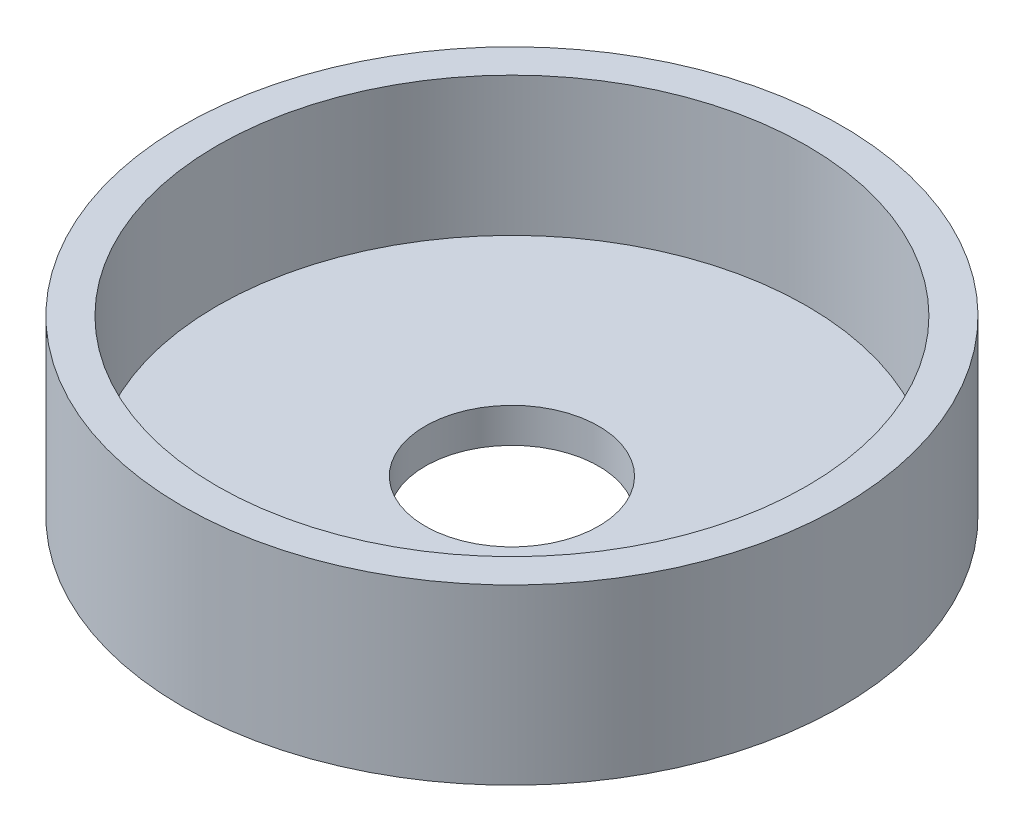
ISO-10303-21;
HEADER;
FILE_DESCRIPTION(('STEP AP214'),'2;1');
FILE_NAME('part.step','',(''),(''),'','','');
FILE_SCHEMA(('AUTOMOTIVE_DESIGN { 1 0 10303 214 1 1 1 1 }'));
ENDSEC;
DATA;
#1=APPLICATION_CONTEXT('core data for automotive mechanical design processes');
#2=APPLICATION_PROTOCOL_DEFINITION('international standard','automotive_design',2000,#1);
#3=PRODUCT_CONTEXT('',#1,'mechanical');
#4=PRODUCT('Part','Part','',(#3));
#5=PRODUCT_RELATED_PRODUCT_CATEGORY('part','',(#4));
#6=PRODUCT_DEFINITION_FORMATION('','',#4);
#7=PRODUCT_DEFINITION_CONTEXT('part definition',#1,'design');
#8=PRODUCT_DEFINITION('design','',#6,#7);
#9=PRODUCT_DEFINITION_SHAPE('','',#8);
#10=(LENGTH_UNIT() NAMED_UNIT(*) SI_UNIT(.MILLI.,.METRE.));
#11=(NAMED_UNIT(*) PLANE_ANGLE_UNIT() SI_UNIT($,.RADIAN.));
#12=(NAMED_UNIT(*) SI_UNIT($,.STERADIAN.) SOLID_ANGLE_UNIT());
#13=UNCERTAINTY_MEASURE_WITH_UNIT(LENGTH_MEASURE(1.E-05),#10,'distance_accuracy_value','');
#14=(GEOMETRIC_REPRESENTATION_CONTEXT(3) GLOBAL_UNCERTAINTY_ASSIGNED_CONTEXT((#13)) GLOBAL_UNIT_ASSIGNED_CONTEXT((#10,
#11,#12)) REPRESENTATION_CONTEXT('',''));
#15=CARTESIAN_POINT('',(0.,0.,0.));
#16=DIRECTION('',(0.,0.,1.));
#17=DIRECTION('',(1.,0.,0.));
#18=AXIS2_PLACEMENT_3D('',#15,#16,#17);
#19=CARTESIAN_POINT('',(0.,1.,0.));
#20=DIRECTION('',(0.,-1.,0.));
#21=DIRECTION('',(0.,0.,-1.));
#22=AXIS2_PLACEMENT_3D('',#19,#20,#21);
#23=CYLINDRICAL_SURFACE('',#22,2.5);
#24=CARTESIAN_POINT('',(0.,1.,0.));
#25=DIRECTION('',(0.,1.,0.));
#26=DIRECTION('',(0.,0.,1.));
#27=AXIS2_PLACEMENT_3D('',#24,#25,#26);
#28=CIRCLE('',#27,2.5);
#29=CARTESIAN_POINT('',(0.,1.,2.5));
#30=VERTEX_POINT('',#29);
#31=EDGE_CURVE('E42',#30,#30,#28,.T.);
#32=ORIENTED_EDGE('',*,*,#31,.T.);
#33=EDGE_LOOP('',(#32));
#34=FACE_BOUND('',#33,.T.);
#35=CARTESIAN_POINT('',(0.,0.,0.));
#36=DIRECTION('',(0.,1.,0.));
#37=DIRECTION('',(0.,0.,1.));
#38=AXIS2_PLACEMENT_3D('',#35,#36,#37);
#39=CIRCLE('',#38,2.5);
#40=CARTESIAN_POINT('',(0.,0.,2.5));
#41=VERTEX_POINT('',#40);
#42=EDGE_CURVE('E51',#41,#41,#39,.T.);
#43=ORIENTED_EDGE('',*,*,#42,.F.);
#44=EDGE_LOOP('',(#43));
#45=FACE_BOUND('',#44,.T.);
#46=ADVANCED_FACE('F35',(#34,#45),#23,.F.);
#47=CARTESIAN_POINT('',(0.,1.,0.));
#48=DIRECTION('',(0.,-1.,0.));
#49=DIRECTION('',(0.,0.,-1.));
#50=AXIS2_PLACEMENT_3D('',#47,#48,#49);
#51=CYLINDRICAL_SURFACE('',#50,9.5);
#52=CARTESIAN_POINT('',(0.,0.,0.));
#53=DIRECTION('',(0.,1.,0.));
#54=DIRECTION('',(0.,0.,1.));
#55=AXIS2_PLACEMENT_3D('',#52,#53,#54);
#56=CIRCLE('',#55,9.5);
#57=CARTESIAN_POINT('',(0.,0.,9.5));
#58=VERTEX_POINT('',#57);
#59=EDGE_CURVE('E38',#58,#58,#56,.T.);
#60=ORIENTED_EDGE('',*,*,#59,.T.);
#61=EDGE_LOOP('',(#60));
#62=FACE_BOUND('',#61,.T.);
#63=CARTESIAN_POINT('',(0.,5.,0.));
#64=DIRECTION('',(0.,1.,0.));
#65=DIRECTION('',(0.,0.,1.));
#66=AXIS2_PLACEMENT_3D('',#63,#64,#65);
#67=CIRCLE('',#66,9.5);
#68=CARTESIAN_POINT('',(0.,5.,9.5));
#69=VERTEX_POINT('',#68);
#70=EDGE_CURVE('E49',#69,#69,#67,.T.);
#71=ORIENTED_EDGE('',*,*,#70,.F.);
#72=EDGE_LOOP('',(#71));
#73=FACE_BOUND('',#72,.T.);
#74=ADVANCED_FACE('F74',(#62,#73),#51,.T.);
#75=CARTESIAN_POINT('',(0.,1.,0.));
#76=DIRECTION('',(0.,1.,0.));
#77=DIRECTION('',(0.,0.,1.));
#78=AXIS2_PLACEMENT_3D('',#75,#76,#77);
#79=PLANE('',#78);
#80=CARTESIAN_POINT('',(0.,1.,0.));
#81=DIRECTION('',(0.,1.,0.));
#82=DIRECTION('',(0.,0.,1.));
#83=AXIS2_PLACEMENT_3D('',#80,#81,#82);
#84=CIRCLE('',#83,8.5);
#85=CARTESIAN_POINT('',(0.,1.,8.5));
#86=VERTEX_POINT('',#85);
#87=EDGE_CURVE('E10',#86,#86,#84,.F.);
#88=ORIENTED_EDGE('',*,*,#87,.F.);
#89=EDGE_LOOP('',(#88));
#90=FACE_BOUND('',#89,.T.);
#91=ORIENTED_EDGE('',*,*,#31,.F.);
#92=EDGE_LOOP('',(#91));
#93=FACE_BOUND('',#92,.T.);
#94=ADVANCED_FACE('F79',(#90,#93),#79,.T.);
#95=CARTESIAN_POINT('',(0.,0.,0.));
#96=DIRECTION('',(0.,1.,0.));
#97=DIRECTION('',(0.,0.,1.));
#98=AXIS2_PLACEMENT_3D('',#95,#96,#97);
#99=PLANE('',#98);
#100=ORIENTED_EDGE('',*,*,#42,.T.);
#101=EDGE_LOOP('',(#100));
#102=FACE_BOUND('',#101,.T.);
#103=ORIENTED_EDGE('',*,*,#59,.F.);
#104=EDGE_LOOP('',(#103));
#105=FACE_BOUND('',#104,.T.);
#106=ADVANCED_FACE('F71',(#102,#105),#99,.F.);
#107=CARTESIAN_POINT('',(0.,5.,0.));
#108=DIRECTION('',(0.,-1.,0.));
#109=DIRECTION('',(0.,0.,-1.));
#110=AXIS2_PLACEMENT_3D('',#107,#108,#109);
#111=CYLINDRICAL_SURFACE('',#110,8.5);
#112=ORIENTED_EDGE('',*,*,#87,.T.);
#113=EDGE_LOOP('',(#112));
#114=FACE_BOUND('',#113,.T.);
#115=CARTESIAN_POINT('',(0.,5.,0.));
#116=DIRECTION('',(0.,1.,0.));
#117=DIRECTION('',(0.,0.,1.));
#118=AXIS2_PLACEMENT_3D('',#115,#116,#117);
#119=CIRCLE('',#118,8.5);
#120=CARTESIAN_POINT('',(0.,5.,8.5));
#121=VERTEX_POINT('',#120);
#122=EDGE_CURVE('E57',#121,#121,#119,.T.);
#123=ORIENTED_EDGE('',*,*,#122,.T.);
#124=EDGE_LOOP('',(#123));
#125=FACE_BOUND('',#124,.T.);
#126=ADVANCED_FACE('F63',(#114,#125),#111,.F.);
#127=CARTESIAN_POINT('',(0.,5.,0.));
#128=DIRECTION('',(0.,1.,0.));
#129=DIRECTION('',(0.,0.,1.));
#130=AXIS2_PLACEMENT_3D('',#127,#128,#129);
#131=PLANE('',#130);
#132=ORIENTED_EDGE('',*,*,#122,.F.);
#133=EDGE_LOOP('',(#132));
#134=FACE_BOUND('',#133,.T.);
#135=ORIENTED_EDGE('',*,*,#70,.T.);
#136=EDGE_LOOP('',(#135));
#137=FACE_BOUND('',#136,.T.);
#138=ADVANCED_FACE('F65',(#134,#137),#131,.T.);
#139=CLOSED_SHELL('',(#46,#74,#94,#106,#126,#138));
#140=MANIFOLD_SOLID_BREP('B2',#139);
#141=ADVANCED_BREP_SHAPE_REPRESENTATION('',(#18,#140),#14);
#142=SHAPE_DEFINITION_REPRESENTATION(#9,#141);
ENDSEC;
END-ISO-10303-21;
